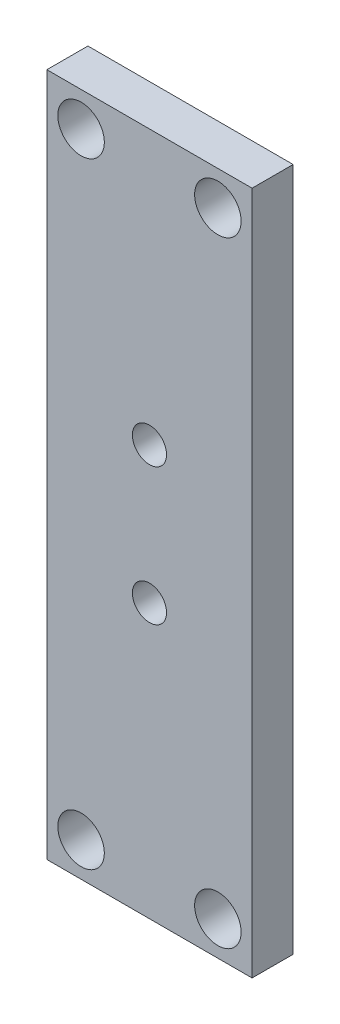
ISO-10303-21;
HEADER;
FILE_DESCRIPTION(('STEP AP214'),'2;1');
FILE_NAME('part.step','',(''),(''),'','','');
FILE_SCHEMA(('AUTOMOTIVE_DESIGN { 1 0 10303 214 1 1 1 1 }'));
ENDSEC;
DATA;
#1=APPLICATION_CONTEXT('core data for automotive mechanical design processes');
#2=APPLICATION_PROTOCOL_DEFINITION('international standard','automotive_design',2000,#1);
#3=PRODUCT_CONTEXT('',#1,'mechanical');
#4=PRODUCT('Part','Part','',(#3));
#5=PRODUCT_RELATED_PRODUCT_CATEGORY('part','',(#4));
#6=PRODUCT_DEFINITION_FORMATION('','',#4);
#7=PRODUCT_DEFINITION_CONTEXT('part definition',#1,'design');
#8=PRODUCT_DEFINITION('design','',#6,#7);
#9=PRODUCT_DEFINITION_SHAPE('','',#8);
#10=(LENGTH_UNIT() NAMED_UNIT(*) SI_UNIT(.MILLI.,.METRE.));
#11=(NAMED_UNIT(*) PLANE_ANGLE_UNIT() SI_UNIT($,.RADIAN.));
#12=(NAMED_UNIT(*) SI_UNIT($,.STERADIAN.) SOLID_ANGLE_UNIT());
#13=UNCERTAINTY_MEASURE_WITH_UNIT(LENGTH_MEASURE(1.E-05),#10,'distance_accuracy_value','');
#14=(GEOMETRIC_REPRESENTATION_CONTEXT(3) GLOBAL_UNCERTAINTY_ASSIGNED_CONTEXT((#13)) GLOBAL_UNIT_ASSIGNED_CONTEXT((#10,
#11,#12)) REPRESENTATION_CONTEXT('',''));
#15=CARTESIAN_POINT('',(0.,0.,0.));
#16=DIRECTION('',(0.,0.,1.));
#17=DIRECTION('',(1.,0.,0.));
#18=AXIS2_PLACEMENT_3D('',#15,#16,#17);
#19=CARTESIAN_POINT('',(7.49999999999999,25.,3.));
#20=DIRECTION('',(-1.,0.,0.));
#21=DIRECTION('',(0.,-1.,0.));
#22=AXIS2_PLACEMENT_3D('',#19,#20,#21);
#23=PLANE('',#22);
#24=DIRECTION('',(0.,1.,0.));
#25=VECTOR('',#24,1.);
#26=CARTESIAN_POINT('',(7.49999999999999,25.,0.));
#27=LINE('',#26,#25);
#28=CARTESIAN_POINT('',(7.5,-25.,0.));
#29=VERTEX_POINT('',#28);
#30=CARTESIAN_POINT('',(7.49999999999999,25.,0.));
#31=VERTEX_POINT('',#30);
#32=EDGE_CURVE('E110',#29,#31,#27,.T.);
#33=ORIENTED_EDGE('',*,*,#32,.T.);
#34=DIRECTION('',(0.,0.,-1.));
#35=VECTOR('',#34,1.);
#36=CARTESIAN_POINT('',(7.49999999999999,25.,3.));
#37=LINE('',#36,#35);
#38=CARTESIAN_POINT('',(7.49999999999999,25.,3.));
#39=VERTEX_POINT('',#38);
#40=EDGE_CURVE('E11',#39,#31,#37,.T.);
#41=ORIENTED_EDGE('',*,*,#40,.F.);
#42=DIRECTION('',(0.,1.,0.));
#43=VECTOR('',#42,1.);
#44=CARTESIAN_POINT('',(7.49999999999999,25.,3.));
#45=LINE('',#44,#43);
#46=CARTESIAN_POINT('',(7.5,-25.,3.));
#47=VERTEX_POINT('',#46);
#48=EDGE_CURVE('E94',#47,#39,#45,.T.);
#49=ORIENTED_EDGE('',*,*,#48,.F.);
#50=DIRECTION('',(0.,0.,-1.));
#51=VECTOR('',#50,1.);
#52=CARTESIAN_POINT('',(7.5,-25.,3.));
#53=LINE('',#52,#51);
#54=EDGE_CURVE('E106',#47,#29,#53,.T.);
#55=ORIENTED_EDGE('',*,*,#54,.T.);
#56=EDGE_LOOP('',(#33,#41,#49,#55));
#57=FACE_BOUND('',#56,.T.);
#58=ADVANCED_FACE('F42',(#57),#23,.F.);
#59=CARTESIAN_POINT('',(-7.50000000000001,25.,3.));
#60=DIRECTION('',(0.,-1.,0.));
#61=DIRECTION('',(0.,0.,-1.));
#62=AXIS2_PLACEMENT_3D('',#59,#60,#61);
#63=PLANE('',#62);
#64=DIRECTION('',(-1.,0.,0.));
#65=VECTOR('',#64,1.);
#66=CARTESIAN_POINT('',(-7.50000000000001,25.,0.));
#67=LINE('',#66,#65);
#68=CARTESIAN_POINT('',(-7.50000000000001,25.,0.));
#69=VERTEX_POINT('',#68);
#70=EDGE_CURVE('E99',#31,#69,#67,.T.);
#71=ORIENTED_EDGE('',*,*,#70,.T.);
#72=DIRECTION('',(0.,0.,-1.));
#73=VECTOR('',#72,1.);
#74=CARTESIAN_POINT('',(-7.50000000000001,25.,3.));
#75=LINE('',#74,#73);
#76=CARTESIAN_POINT('',(-7.50000000000001,25.,3.));
#77=VERTEX_POINT('',#76);
#78=EDGE_CURVE('E51',#77,#69,#75,.T.);
#79=ORIENTED_EDGE('',*,*,#78,.F.);
#80=DIRECTION('',(-1.,0.,0.));
#81=VECTOR('',#80,1.);
#82=CARTESIAN_POINT('',(-7.50000000000001,25.,3.));
#83=LINE('',#82,#81);
#84=EDGE_CURVE('E89',#39,#77,#83,.T.);
#85=ORIENTED_EDGE('',*,*,#84,.F.);
#86=ORIENTED_EDGE('',*,*,#40,.T.);
#87=EDGE_LOOP('',(#71,#79,#85,#86));
#88=FACE_BOUND('',#87,.T.);
#89=ADVANCED_FACE('F98',(#88),#63,.F.);
#90=CARTESIAN_POINT('',(-7.50000000000001,25.,3.));
#91=DIRECTION('',(1.,0.,0.));
#92=DIRECTION('',(0.,1.,0.));
#93=AXIS2_PLACEMENT_3D('',#90,#91,#92);
#94=PLANE('',#93);
#95=DIRECTION('',(0.,-1.,0.));
#96=VECTOR('',#95,1.);
#97=CARTESIAN_POINT('',(-7.50000000000001,25.,0.));
#98=LINE('',#97,#96);
#99=CARTESIAN_POINT('',(-7.5,-25.,0.));
#100=VERTEX_POINT('',#99);
#101=EDGE_CURVE('E76',#69,#100,#98,.T.);
#102=ORIENTED_EDGE('',*,*,#101,.T.);
#103=DIRECTION('',(0.,0.,-1.));
#104=VECTOR('',#103,1.);
#105=CARTESIAN_POINT('',(-7.5,-25.,3.));
#106=LINE('',#105,#104);
#107=CARTESIAN_POINT('',(-7.5,-25.,3.));
#108=VERTEX_POINT('',#107);
#109=EDGE_CURVE('E101',#108,#100,#106,.T.);
#110=ORIENTED_EDGE('',*,*,#109,.F.);
#111=DIRECTION('',(0.,-1.,0.));
#112=VECTOR('',#111,1.);
#113=CARTESIAN_POINT('',(-7.50000000000001,25.,3.));
#114=LINE('',#113,#112);
#115=EDGE_CURVE('E92',#77,#108,#114,.T.);
#116=ORIENTED_EDGE('',*,*,#115,.F.);
#117=ORIENTED_EDGE('',*,*,#78,.T.);
#118=EDGE_LOOP('',(#102,#110,#116,#117));
#119=FACE_BOUND('',#118,.T.);
#120=ADVANCED_FACE('F102',(#119),#94,.F.);
#121=CARTESIAN_POINT('',(-7.5,-25.,3.));
#122=DIRECTION('',(0.,1.,0.));
#123=DIRECTION('',(0.,0.,1.));
#124=AXIS2_PLACEMENT_3D('',#121,#122,#123);
#125=PLANE('',#124);
#126=DIRECTION('',(1.,0.,0.));
#127=VECTOR('',#126,1.);
#128=CARTESIAN_POINT('',(-7.5,-25.,0.));
#129=LINE('',#128,#127);
#130=EDGE_CURVE('E82',#100,#29,#129,.T.);
#131=ORIENTED_EDGE('',*,*,#130,.T.);
#132=ORIENTED_EDGE('',*,*,#54,.F.);
#133=DIRECTION('',(1.,0.,0.));
#134=VECTOR('',#133,1.);
#135=CARTESIAN_POINT('',(-7.5,-25.,3.));
#136=LINE('',#135,#134);
#137=EDGE_CURVE('E59',#108,#47,#136,.T.);
#138=ORIENTED_EDGE('',*,*,#137,.F.);
#139=ORIENTED_EDGE('',*,*,#109,.T.);
#140=EDGE_LOOP('',(#131,#132,#138,#139));
#141=FACE_BOUND('',#140,.T.);
#142=ADVANCED_FACE('F124',(#141),#125,.F.);
#143=CARTESIAN_POINT('',(0.,0.,3.));
#144=DIRECTION('',(0.,0.,1.));
#145=DIRECTION('',(1.,0.,0.));
#146=AXIS2_PLACEMENT_3D('',#143,#144,#145);
#147=PLANE('',#146);
#148=CARTESIAN_POINT('',(-5.,22.5,3.));
#149=DIRECTION('',(0.,0.,1.));
#150=DIRECTION('',(1.,0.,0.));
#151=AXIS2_PLACEMENT_3D('',#148,#149,#150);
#152=CIRCLE('',#151,1.69999999999999);
#153=CARTESIAN_POINT('',(-3.30000000000002,22.5,3.));
#154=VERTEX_POINT('',#153);
#155=EDGE_CURVE('E174',#154,#154,#152,.T.);
#156=ORIENTED_EDGE('',*,*,#155,.F.);
#157=EDGE_LOOP('',(#156));
#158=FACE_BOUND('',#157,.T.);
#159=CARTESIAN_POINT('',(5.,22.5,3.));
#160=DIRECTION('',(0.,0.,1.));
#161=DIRECTION('',(1.,0.,0.));
#162=AXIS2_PLACEMENT_3D('',#159,#160,#161);
#163=CIRCLE('',#162,1.69999999999999);
#164=CARTESIAN_POINT('',(6.69999999999999,22.5,3.));
#165=VERTEX_POINT('',#164);
#166=EDGE_CURVE('E166',#165,#165,#163,.T.);
#167=ORIENTED_EDGE('',*,*,#166,.F.);
#168=EDGE_LOOP('',(#167));
#169=FACE_BOUND('',#168,.T.);
#170=CARTESIAN_POINT('',(-5.,-22.5,3.));
#171=DIRECTION('',(0.,0.,1.));
#172=DIRECTION('',(1.,0.,0.));
#173=AXIS2_PLACEMENT_3D('',#170,#171,#172);
#174=CIRCLE('',#173,1.69999999999999);
#175=CARTESIAN_POINT('',(-3.30000000000002,-22.5,3.));
#176=VERTEX_POINT('',#175);
#177=EDGE_CURVE('E158',#176,#176,#174,.T.);
#178=ORIENTED_EDGE('',*,*,#177,.F.);
#179=EDGE_LOOP('',(#178));
#180=FACE_BOUND('',#179,.T.);
#181=CARTESIAN_POINT('',(5.,-22.5,3.));
#182=DIRECTION('',(0.,0.,1.));
#183=DIRECTION('',(1.,0.,0.));
#184=AXIS2_PLACEMENT_3D('',#181,#182,#183);
#185=CIRCLE('',#184,1.69999999999999);
#186=CARTESIAN_POINT('',(6.69999999999999,-22.5,3.));
#187=VERTEX_POINT('',#186);
#188=EDGE_CURVE('E150',#187,#187,#185,.T.);
#189=ORIENTED_EDGE('',*,*,#188,.F.);
#190=EDGE_LOOP('',(#189));
#191=FACE_BOUND('',#190,.T.);
#192=CARTESIAN_POINT('',(0.,4.99999999999999,3.));
#193=DIRECTION('',(0.,0.,1.));
#194=DIRECTION('',(1.,0.,0.));
#195=AXIS2_PLACEMENT_3D('',#192,#193,#194);
#196=CIRCLE('',#195,1.25);
#197=CARTESIAN_POINT('',(1.25,4.99999999999999,3.));
#198=VERTEX_POINT('',#197);
#199=EDGE_CURVE('E142',#198,#198,#196,.T.);
#200=ORIENTED_EDGE('',*,*,#199,.F.);
#201=EDGE_LOOP('',(#200));
#202=FACE_BOUND('',#201,.T.);
#203=CARTESIAN_POINT('',(0.,-5.00000000000001,3.));
#204=DIRECTION('',(0.,0.,1.));
#205=DIRECTION('',(1.,0.,0.));
#206=AXIS2_PLACEMENT_3D('',#203,#204,#205);
#207=CIRCLE('',#206,1.25);
#208=CARTESIAN_POINT('',(1.25,-5.00000000000001,3.));
#209=VERTEX_POINT('',#208);
#210=EDGE_CURVE('E134',#209,#209,#207,.T.);
#211=ORIENTED_EDGE('',*,*,#210,.F.);
#212=EDGE_LOOP('',(#211));
#213=FACE_BOUND('',#212,.T.);
#214=ORIENTED_EDGE('',*,*,#48,.T.);
#215=ORIENTED_EDGE('',*,*,#84,.T.);
#216=ORIENTED_EDGE('',*,*,#115,.T.);
#217=ORIENTED_EDGE('',*,*,#137,.T.);
#218=EDGE_LOOP('',(#214,#215,#216,#217));
#219=FACE_BOUND('',#218,.T.);
#220=ADVANCED_FACE('F90',(#158,#169,#180,#191,#202,#213,#219),#147,.T.);
#221=CARTESIAN_POINT('',(0.,0.,0.));
#222=DIRECTION('',(0.,0.,1.));
#223=DIRECTION('',(1.,0.,0.));
#224=AXIS2_PLACEMENT_3D('',#221,#222,#223);
#225=PLANE('',#224);
#226=CARTESIAN_POINT('',(-5.,22.5,0.));
#227=DIRECTION('',(0.,0.,1.));
#228=DIRECTION('',(1.,0.,0.));
#229=AXIS2_PLACEMENT_3D('',#226,#227,#228);
#230=CIRCLE('',#229,1.7);
#231=CARTESIAN_POINT('',(-3.30000000000001,22.5,0.));
#232=VERTEX_POINT('',#231);
#233=EDGE_CURVE('E170',#232,#232,#230,.T.);
#234=ORIENTED_EDGE('',*,*,#233,.T.);
#235=EDGE_LOOP('',(#234));
#236=FACE_BOUND('',#235,.T.);
#237=CARTESIAN_POINT('',(5.,22.5,0.));
#238=DIRECTION('',(0.,0.,1.));
#239=DIRECTION('',(1.,0.,0.));
#240=AXIS2_PLACEMENT_3D('',#237,#238,#239);
#241=CIRCLE('',#240,1.7);
#242=CARTESIAN_POINT('',(6.7,22.5,0.));
#243=VERTEX_POINT('',#242);
#244=EDGE_CURVE('E162',#243,#243,#241,.T.);
#245=ORIENTED_EDGE('',*,*,#244,.T.);
#246=EDGE_LOOP('',(#245));
#247=FACE_BOUND('',#246,.T.);
#248=CARTESIAN_POINT('',(-5.,-22.5,0.));
#249=DIRECTION('',(0.,0.,1.));
#250=DIRECTION('',(1.,0.,0.));
#251=AXIS2_PLACEMENT_3D('',#248,#249,#250);
#252=CIRCLE('',#251,1.7);
#253=CARTESIAN_POINT('',(-3.30000000000001,-22.5,0.));
#254=VERTEX_POINT('',#253);
#255=EDGE_CURVE('E154',#254,#254,#252,.T.);
#256=ORIENTED_EDGE('',*,*,#255,.T.);
#257=EDGE_LOOP('',(#256));
#258=FACE_BOUND('',#257,.T.);
#259=CARTESIAN_POINT('',(5.,-22.5,0.));
#260=DIRECTION('',(0.,0.,1.));
#261=DIRECTION('',(1.,0.,0.));
#262=AXIS2_PLACEMENT_3D('',#259,#260,#261);
#263=CIRCLE('',#262,1.7);
#264=CARTESIAN_POINT('',(6.7,-22.5,0.));
#265=VERTEX_POINT('',#264);
#266=EDGE_CURVE('E146',#265,#265,#263,.T.);
#267=ORIENTED_EDGE('',*,*,#266,.T.);
#268=EDGE_LOOP('',(#267));
#269=FACE_BOUND('',#268,.T.);
#270=CARTESIAN_POINT('',(0.,4.99999999999999,0.));
#271=DIRECTION('',(0.,0.,1.));
#272=DIRECTION('',(1.,0.,0.));
#273=AXIS2_PLACEMENT_3D('',#270,#271,#272);
#274=CIRCLE('',#273,1.25);
#275=CARTESIAN_POINT('',(1.25,4.99999999999999,0.));
#276=VERTEX_POINT('',#275);
#277=EDGE_CURVE('E138',#276,#276,#274,.T.);
#278=ORIENTED_EDGE('',*,*,#277,.T.);
#279=EDGE_LOOP('',(#278));
#280=FACE_BOUND('',#279,.T.);
#281=CARTESIAN_POINT('',(0.,-5.00000000000001,0.));
#282=DIRECTION('',(0.,0.,1.));
#283=DIRECTION('',(1.,0.,0.));
#284=AXIS2_PLACEMENT_3D('',#281,#282,#283);
#285=CIRCLE('',#284,1.25);
#286=CARTESIAN_POINT('',(1.25,-5.00000000000001,0.));
#287=VERTEX_POINT('',#286);
#288=EDGE_CURVE('E114',#287,#287,#285,.T.);
#289=ORIENTED_EDGE('',*,*,#288,.T.);
#290=EDGE_LOOP('',(#289));
#291=FACE_BOUND('',#290,.T.);
#292=ORIENTED_EDGE('',*,*,#32,.F.);
#293=ORIENTED_EDGE('',*,*,#130,.F.);
#294=ORIENTED_EDGE('',*,*,#101,.F.);
#295=ORIENTED_EDGE('',*,*,#70,.F.);
#296=EDGE_LOOP('',(#292,#293,#294,#295));
#297=FACE_BOUND('',#296,.T.);
#298=ADVANCED_FACE('F127',(#236,#247,#258,#269,#280,#291,#297),#225,.F.);
#299=CARTESIAN_POINT('',(0.,-5.00000000000001,3.));
#300=DIRECTION('',(0.,0.,1.));
#301=DIRECTION('',(1.,0.,0.));
#302=AXIS2_PLACEMENT_3D('',#299,#300,#301);
#303=CYLINDRICAL_SURFACE('',#302,1.25);
#304=ORIENTED_EDGE('',*,*,#288,.F.);
#305=EDGE_LOOP('',(#304));
#306=FACE_BOUND('',#305,.T.);
#307=ORIENTED_EDGE('',*,*,#210,.T.);
#308=EDGE_LOOP('',(#307));
#309=FACE_BOUND('',#308,.T.);
#310=ADVANCED_FACE('F194',(#306,#309),#303,.F.);
#311=CARTESIAN_POINT('',(0.,4.99999999999999,3.));
#312=DIRECTION('',(0.,0.,1.));
#313=DIRECTION('',(1.,0.,0.));
#314=AXIS2_PLACEMENT_3D('',#311,#312,#313);
#315=CYLINDRICAL_SURFACE('',#314,1.25);
#316=ORIENTED_EDGE('',*,*,#277,.F.);
#317=EDGE_LOOP('',(#316));
#318=FACE_BOUND('',#317,.T.);
#319=ORIENTED_EDGE('',*,*,#199,.T.);
#320=EDGE_LOOP('',(#319));
#321=FACE_BOUND('',#320,.T.);
#322=ADVANCED_FACE('F196',(#318,#321),#315,.F.);
#323=CARTESIAN_POINT('',(5.,-22.5,3.));
#324=DIRECTION('',(0.,0.,1.));
#325=DIRECTION('',(1.,0.,0.));
#326=AXIS2_PLACEMENT_3D('',#323,#324,#325);
#327=CYLINDRICAL_SURFACE('',#326,1.69999999999999);
#328=ORIENTED_EDGE('',*,*,#266,.F.);
#329=EDGE_LOOP('',(#328));
#330=FACE_BOUND('',#329,.T.);
#331=ORIENTED_EDGE('',*,*,#188,.T.);
#332=EDGE_LOOP('',(#331));
#333=FACE_BOUND('',#332,.T.);
#334=ADVANCED_FACE('F203',(#330,#333),#327,.F.);
#335=CARTESIAN_POINT('',(-5.,-22.5,3.));
#336=DIRECTION('',(0.,0.,1.));
#337=DIRECTION('',(1.,0.,0.));
#338=AXIS2_PLACEMENT_3D('',#335,#336,#337);
#339=CYLINDRICAL_SURFACE('',#338,1.69999999999999);
#340=ORIENTED_EDGE('',*,*,#255,.F.);
#341=EDGE_LOOP('',(#340));
#342=FACE_BOUND('',#341,.T.);
#343=ORIENTED_EDGE('',*,*,#177,.T.);
#344=EDGE_LOOP('',(#343));
#345=FACE_BOUND('',#344,.T.);
#346=ADVANCED_FACE('F255',(#342,#345),#339,.F.);
#347=CARTESIAN_POINT('',(5.,22.5,3.));
#348=DIRECTION('',(0.,0.,1.));
#349=DIRECTION('',(1.,0.,0.));
#350=AXIS2_PLACEMENT_3D('',#347,#348,#349);
#351=CYLINDRICAL_SURFACE('',#350,1.69999999999999);
#352=ORIENTED_EDGE('',*,*,#244,.F.);
#353=EDGE_LOOP('',(#352));
#354=FACE_BOUND('',#353,.T.);
#355=ORIENTED_EDGE('',*,*,#166,.T.);
#356=EDGE_LOOP('',(#355));
#357=FACE_BOUND('',#356,.T.);
#358=ADVANCED_FACE('F263',(#354,#357),#351,.F.);
#359=CARTESIAN_POINT('',(-5.,22.5,3.));
#360=DIRECTION('',(0.,0.,1.));
#361=DIRECTION('',(1.,0.,0.));
#362=AXIS2_PLACEMENT_3D('',#359,#360,#361);
#363=CYLINDRICAL_SURFACE('',#362,1.69999999999999);
#364=ORIENTED_EDGE('',*,*,#233,.F.);
#365=EDGE_LOOP('',(#364));
#366=FACE_BOUND('',#365,.T.);
#367=ORIENTED_EDGE('',*,*,#155,.T.);
#368=EDGE_LOOP('',(#367));
#369=FACE_BOUND('',#368,.T.);
#370=ADVANCED_FACE('F179',(#366,#369),#363,.F.);
#371=CLOSED_SHELL('',(#58,#89,#120,#142,#220,#298,#310,#322,#334,#346,#358,#370));
#372=MANIFOLD_SOLID_BREP('B2',#371);
#373=ADVANCED_BREP_SHAPE_REPRESENTATION('',(#18,#372),#14);
#374=SHAPE_DEFINITION_REPRESENTATION(#9,#373);
ENDSEC;
END-ISO-10303-21;
